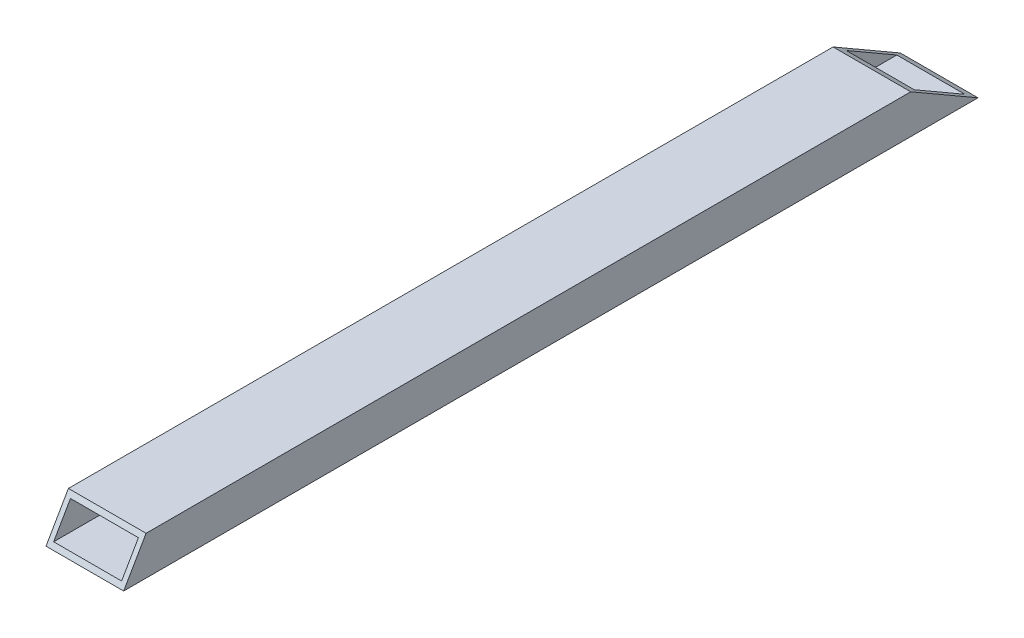
ISO-10303-21;
HEADER;
FILE_DESCRIPTION(('STEP AP214'),'2;1');
FILE_NAME('part.step','',(''),(''),'','','');
FILE_SCHEMA(('AUTOMOTIVE_DESIGN { 1 0 10303 214 1 1 1 1 }'));
ENDSEC;
DATA;
#1=APPLICATION_CONTEXT('core data for automotive mechanical design processes');
#2=APPLICATION_PROTOCOL_DEFINITION('international standard','automotive_design',2000,#1);
#3=PRODUCT_CONTEXT('',#1,'mechanical');
#4=PRODUCT('Part','Part','',(#3));
#5=PRODUCT_RELATED_PRODUCT_CATEGORY('part','',(#4));
#6=PRODUCT_DEFINITION_FORMATION('','',#4);
#7=PRODUCT_DEFINITION_CONTEXT('part definition',#1,'design');
#8=PRODUCT_DEFINITION('design','',#6,#7);
#9=PRODUCT_DEFINITION_SHAPE('','',#8);
#10=(LENGTH_UNIT() NAMED_UNIT(*) SI_UNIT(.MILLI.,.METRE.));
#11=(NAMED_UNIT(*) PLANE_ANGLE_UNIT() SI_UNIT($,.RADIAN.));
#12=(NAMED_UNIT(*) SI_UNIT($,.STERADIAN.) SOLID_ANGLE_UNIT());
#13=UNCERTAINTY_MEASURE_WITH_UNIT(LENGTH_MEASURE(1.E-05),#10,'distance_accuracy_value','');
#14=(GEOMETRIC_REPRESENTATION_CONTEXT(3) GLOBAL_UNCERTAINTY_ASSIGNED_CONTEXT((#13)) GLOBAL_UNIT_ASSIGNED_CONTEXT((#10,
#11,#12)) REPRESENTATION_CONTEXT('',''));
#15=CARTESIAN_POINT('',(0.,0.,0.));
#16=DIRECTION('',(0.,0.,1.));
#17=DIRECTION('',(1.,0.,0.));
#18=AXIS2_PLACEMENT_3D('',#15,#16,#17);
#19=CARTESIAN_POINT('',(25.4,12.7,-235.405909487751));
#20=DIRECTION('',(0.,-0.866025403784438,0.500000000000001));
#21=DIRECTION('',(0.,-0.500000000000001,-0.866025403784438));
#22=AXIS2_PLACEMENT_3D('',#19,#20,#21);
#23=PLANE('',#22);
#24=DIRECTION('',(0.,-0.500000000000001,-0.866025403784438));
#25=VECTOR('',#24,1.);
#26=CARTESIAN_POINT('',(-25.4,60.4918744543431,-152.627954743875));
#27=LINE('',#26,#25);
#28=CARTESIAN_POINT('',(-25.4,12.7,-235.405909487751));
#29=VERTEX_POINT('',#28);
#30=CARTESIAN_POINT('',(-25.4,-12.7,-279.4));
#31=VERTEX_POINT('',#30);
#32=EDGE_CURVE('E35',#29,#31,#27,.T.);
#33=ORIENTED_EDGE('',*,*,#32,.F.);
#34=DIRECTION('',(-1.,0.,0.));
#35=VECTOR('',#34,1.);
#36=CARTESIAN_POINT('',(0.,12.7,-235.405909487751));
#37=LINE('',#36,#35);
#38=CARTESIAN_POINT('',(25.4,12.7,-235.405909487751));
#39=VERTEX_POINT('',#38);
#40=EDGE_CURVE('E131',#39,#29,#37,.T.);
#41=ORIENTED_EDGE('',*,*,#40,.F.);
#42=DIRECTION('',(0.,0.500000000000001,0.866025403784438));
#43=VECTOR('',#42,1.);
#44=CARTESIAN_POINT('',(25.4,63.6668744543431,-147.128693429844));
#45=LINE('',#44,#43);
#46=CARTESIAN_POINT('',(25.4,-12.7,-279.4));
#47=VERTEX_POINT('',#46);
#48=EDGE_CURVE('E10',#47,#39,#45,.T.);
#49=ORIENTED_EDGE('',*,*,#48,.F.);
#50=DIRECTION('',(1.,0.,0.));
#51=VECTOR('',#50,1.);
#52=CARTESIAN_POINT('',(25.4,-12.7,-279.4));
#53=LINE('',#52,#51);
#54=EDGE_CURVE('E144',#31,#47,#53,.T.);
#55=ORIENTED_EDGE('',*,*,#54,.F.);
#56=EDGE_LOOP('',(#33,#41,#49,#55));
#57=FACE_BOUND('',#56,.T.);
#58=DIRECTION('',(0.,0.500000000000001,0.866025403784438));
#59=VECTOR('',#58,1.);
#60=CARTESIAN_POINT('',(-22.225,60.8887494543431,-151.940547079621));
#61=LINE('',#60,#59);
#62=CARTESIAN_POINT('',(-22.225,-9.525,-273.900738685969));
#63=VERTEX_POINT('',#62);
#64=CARTESIAN_POINT('',(-22.225,9.525,-240.905170801782));
#65=VERTEX_POINT('',#64);
#66=EDGE_CURVE('E106',#63,#65,#61,.T.);
#67=ORIENTED_EDGE('',*,*,#66,.F.);
#68=DIRECTION('',(-1.,0.,0.));
#69=VECTOR('',#68,1.);
#70=CARTESIAN_POINT('',(23.8125,-9.525,-273.900738685969));
#71=LINE('',#70,#69);
#72=CARTESIAN_POINT('',(22.225,-9.525,-273.900738685969));
#73=VERTEX_POINT('',#72);
#74=EDGE_CURVE('E116',#73,#63,#71,.T.);
#75=ORIENTED_EDGE('',*,*,#74,.F.);
#76=DIRECTION('',(0.,-0.500000000000001,-0.866025403784438));
#77=VECTOR('',#76,1.);
#78=CARTESIAN_POINT('',(22.225,63.2699994543431,-147.816101094098));
#79=LINE('',#78,#77);
#80=CARTESIAN_POINT('',(22.225,9.525,-240.905170801782));
#81=VERTEX_POINT('',#80);
#82=EDGE_CURVE('E123',#81,#73,#79,.T.);
#83=ORIENTED_EDGE('',*,*,#82,.F.);
#84=DIRECTION('',(1.,0.,0.));
#85=VECTOR('',#84,1.);
#86=CARTESIAN_POINT('',(1.5875,9.52499999999999,-240.905170801782));
#87=LINE('',#86,#85);
#88=EDGE_CURVE('E93',#65,#81,#87,.T.);
#89=ORIENTED_EDGE('',*,*,#88,.F.);
#90=EDGE_LOOP('',(#67,#75,#83,#89));
#91=FACE_BOUND('',#90,.T.);
#92=ADVANCED_FACE('F16',(#57,#91),#23,.F.);
#93=CARTESIAN_POINT('',(25.4,12.7,0.));
#94=DIRECTION('',(1.,0.,0.));
#95=DIRECTION('',(0.,0.,-1.));
#96=AXIS2_PLACEMENT_3D('',#93,#94,#95);
#97=PLANE('',#96);
#98=ORIENTED_EDGE('',*,*,#48,.T.);
#99=DIRECTION('',(0.,0.,-1.));
#100=VECTOR('',#99,1.);
#101=CARTESIAN_POINT('',(25.4,12.7,0.));
#102=LINE('',#101,#100);
#103=CARTESIAN_POINT('',(25.4,12.7,264.735303162584));
#104=VERTEX_POINT('',#103);
#105=EDGE_CURVE('E128',#104,#39,#102,.T.);
#106=ORIENTED_EDGE('',*,*,#105,.F.);
#107=DIRECTION('',(0.,-0.866025403784439,0.5));
#108=VECTOR('',#107,1.);
#109=CARTESIAN_POINT('',(25.4,57.316874454343,238.975738685969));
#110=LINE('',#109,#108);
#111=CARTESIAN_POINT('',(25.4,-12.7,279.4));
#112=VERTEX_POINT('',#111);
#113=EDGE_CURVE('E26',#104,#112,#110,.T.);
#114=ORIENTED_EDGE('',*,*,#113,.T.);
#115=DIRECTION('',(0.,0.,-1.));
#116=VECTOR('',#115,1.);
#117=CARTESIAN_POINT('',(25.4,-12.7,0.));
#118=LINE('',#117,#116);
#119=EDGE_CURVE('E132',#112,#47,#118,.T.);
#120=ORIENTED_EDGE('',*,*,#119,.T.);
#121=EDGE_LOOP('',(#98,#106,#114,#120));
#122=FACE_BOUND('',#121,.T.);
#123=ADVANCED_FACE('F154',(#122),#97,.T.);
#124=CARTESIAN_POINT('',(-25.4,12.7,0.));
#125=DIRECTION('',(0.,1.,0.));
#126=DIRECTION('',(0.,0.,1.));
#127=AXIS2_PLACEMENT_3D('',#124,#125,#126);
#128=PLANE('',#127);
#129=ORIENTED_EDGE('',*,*,#40,.T.);
#130=DIRECTION('',(0.,0.,1.));
#131=VECTOR('',#130,1.);
#132=CARTESIAN_POINT('',(-25.4,12.7,0.));
#133=LINE('',#132,#131);
#134=CARTESIAN_POINT('',(-25.4,12.7,264.735303162584));
#135=VERTEX_POINT('',#134);
#136=EDGE_CURVE('E127',#29,#135,#133,.T.);
#137=ORIENTED_EDGE('',*,*,#136,.T.);
#138=DIRECTION('',(1.,0.,0.));
#139=VECTOR('',#138,1.);
#140=CARTESIAN_POINT('',(0.,12.7,264.735303162584));
#141=LINE('',#140,#139);
#142=EDGE_CURVE('E124',#135,#104,#141,.T.);
#143=ORIENTED_EDGE('',*,*,#142,.T.);
#144=ORIENTED_EDGE('',*,*,#105,.T.);
#145=EDGE_LOOP('',(#129,#137,#143,#144));
#146=FACE_BOUND('',#145,.T.);
#147=ADVANCED_FACE('F158',(#146),#128,.T.);
#148=CARTESIAN_POINT('',(22.225,9.525,0.));
#149=DIRECTION('',(1.,0.,0.));
#150=DIRECTION('',(0.,0.,-1.));
#151=AXIS2_PLACEMENT_3D('',#148,#149,#150);
#152=PLANE('',#151);
#153=ORIENTED_EDGE('',*,*,#82,.T.);
#154=DIRECTION('',(0.,0.,1.));
#155=VECTOR('',#154,1.);
#156=CARTESIAN_POINT('',(22.225,-9.525,0.));
#157=LINE('',#156,#155);
#158=CARTESIAN_POINT('',(22.225,-9.525,277.566912895323));
#159=VERTEX_POINT('',#158);
#160=EDGE_CURVE('E120',#73,#159,#157,.T.);
#161=ORIENTED_EDGE('',*,*,#160,.T.);
#162=DIRECTION('',(0.,0.866025403784439,-0.5));
#163=VECTOR('',#162,1.);
#164=CARTESIAN_POINT('',(22.225,56.126249454343,239.663146350223));
#165=LINE('',#164,#163);
#166=CARTESIAN_POINT('',(22.225,9.525,266.568390267261));
#167=VERTEX_POINT('',#166);
#168=EDGE_CURVE('E118',#159,#167,#165,.T.);
#169=ORIENTED_EDGE('',*,*,#168,.T.);
#170=DIRECTION('',(0.,0.,-1.));
#171=VECTOR('',#170,1.);
#172=CARTESIAN_POINT('',(22.225,9.525,0.));
#173=LINE('',#172,#171);
#174=EDGE_CURVE('E90',#167,#81,#173,.T.);
#175=ORIENTED_EDGE('',*,*,#174,.T.);
#176=EDGE_LOOP('',(#153,#161,#169,#175));
#177=FACE_BOUND('',#176,.T.);
#178=ADVANCED_FACE('F160',(#177),#152,.F.);
#179=CARTESIAN_POINT('',(22.225,-9.525,0.));
#180=DIRECTION('',(0.,-1.,0.));
#181=DIRECTION('',(0.,0.,-1.));
#182=AXIS2_PLACEMENT_3D('',#179,#180,#181);
#183=PLANE('',#182);
#184=ORIENTED_EDGE('',*,*,#74,.T.);
#185=DIRECTION('',(0.,0.,1.));
#186=VECTOR('',#185,1.);
#187=CARTESIAN_POINT('',(-22.225,-9.525,0.));
#188=LINE('',#187,#186);
#189=CARTESIAN_POINT('',(-22.225,-9.525,277.566912895323));
#190=VERTEX_POINT('',#189);
#191=EDGE_CURVE('E114',#63,#190,#188,.T.);
#192=ORIENTED_EDGE('',*,*,#191,.T.);
#193=DIRECTION('',(1.,0.,0.));
#194=VECTOR('',#193,1.);
#195=CARTESIAN_POINT('',(23.8125,-9.525,277.566912895323));
#196=LINE('',#195,#194);
#197=EDGE_CURVE('E99',#190,#159,#196,.T.);
#198=ORIENTED_EDGE('',*,*,#197,.T.);
#199=ORIENTED_EDGE('',*,*,#160,.F.);
#200=EDGE_LOOP('',(#184,#192,#198,#199));
#201=FACE_BOUND('',#200,.T.);
#202=ADVANCED_FACE('F167',(#201),#183,.F.);
#203=CARTESIAN_POINT('',(25.4,-12.7,279.4));
#204=DIRECTION('',(0.,-0.5,-0.866025403784439));
#205=DIRECTION('',(0.,0.866025403784439,-0.5));
#206=AXIS2_PLACEMENT_3D('',#203,#204,#205);
#207=PLANE('',#206);
#208=DIRECTION('',(0.,0.866025403784439,-0.5));
#209=VECTOR('',#208,1.);
#210=CARTESIAN_POINT('',(-25.4,47.791874454343,244.475));
#211=LINE('',#210,#209);
#212=CARTESIAN_POINT('',(-25.4,-12.7,279.4));
#213=VERTEX_POINT('',#212);
#214=EDGE_CURVE('E110',#213,#135,#211,.T.);
#215=ORIENTED_EDGE('',*,*,#214,.F.);
#216=DIRECTION('',(-1.,0.,0.));
#217=VECTOR('',#216,1.);
#218=CARTESIAN_POINT('',(25.4,-12.7,279.4));
#219=LINE('',#218,#217);
#220=EDGE_CURVE('E78',#112,#213,#219,.T.);
#221=ORIENTED_EDGE('',*,*,#220,.F.);
#222=ORIENTED_EDGE('',*,*,#113,.F.);
#223=ORIENTED_EDGE('',*,*,#142,.F.);
#224=EDGE_LOOP('',(#215,#221,#222,#223));
#225=FACE_BOUND('',#224,.T.);
#226=ORIENTED_EDGE('',*,*,#168,.F.);
#227=ORIENTED_EDGE('',*,*,#197,.F.);
#228=DIRECTION('',(0.,-0.866025403784439,0.5));
#229=VECTOR('',#228,1.);
#230=CARTESIAN_POINT('',(-22.225,48.982499454343,243.787592335746));
#231=LINE('',#230,#229);
#232=CARTESIAN_POINT('',(-22.225,9.525,266.568390267261));
#233=VERTEX_POINT('',#232);
#234=EDGE_CURVE('E96',#233,#190,#231,.T.);
#235=ORIENTED_EDGE('',*,*,#234,.F.);
#236=DIRECTION('',(-1.,0.,0.));
#237=VECTOR('',#236,1.);
#238=CARTESIAN_POINT('',(1.5875,9.52500000000001,266.568390267261));
#239=LINE('',#238,#237);
#240=EDGE_CURVE('E84',#167,#233,#239,.T.);
#241=ORIENTED_EDGE('',*,*,#240,.F.);
#242=EDGE_LOOP('',(#226,#227,#235,#241));
#243=FACE_BOUND('',#242,.T.);
#244=ADVANCED_FACE('F97',(#225,#243),#207,.F.);
#245=CARTESIAN_POINT('',(-22.225,-9.525,0.));
#246=DIRECTION('',(-1.,0.,0.));
#247=DIRECTION('',(0.,0.,1.));
#248=AXIS2_PLACEMENT_3D('',#245,#246,#247);
#249=PLANE('',#248);
#250=ORIENTED_EDGE('',*,*,#66,.T.);
#251=DIRECTION('',(0.,0.,1.));
#252=VECTOR('',#251,1.);
#253=CARTESIAN_POINT('',(-22.225,9.525,0.));
#254=LINE('',#253,#252);
#255=EDGE_CURVE('E88',#65,#233,#254,.T.);
#256=ORIENTED_EDGE('',*,*,#255,.T.);
#257=ORIENTED_EDGE('',*,*,#234,.T.);
#258=ORIENTED_EDGE('',*,*,#191,.F.);
#259=EDGE_LOOP('',(#250,#256,#257,#258));
#260=FACE_BOUND('',#259,.T.);
#261=ADVANCED_FACE('F105',(#260),#249,.F.);
#262=CARTESIAN_POINT('',(-25.4,-12.7,0.));
#263=DIRECTION('',(-1.,0.,0.));
#264=DIRECTION('',(0.,0.,1.));
#265=AXIS2_PLACEMENT_3D('',#262,#263,#264);
#266=PLANE('',#265);
#267=ORIENTED_EDGE('',*,*,#32,.T.);
#268=DIRECTION('',(0.,0.,-1.));
#269=VECTOR('',#268,1.);
#270=CARTESIAN_POINT('',(-25.4,-12.7,0.));
#271=LINE('',#270,#269);
#272=EDGE_CURVE('E20',#213,#31,#271,.T.);
#273=ORIENTED_EDGE('',*,*,#272,.F.);
#274=ORIENTED_EDGE('',*,*,#214,.T.);
#275=ORIENTED_EDGE('',*,*,#136,.F.);
#276=EDGE_LOOP('',(#267,#273,#274,#275));
#277=FACE_BOUND('',#276,.T.);
#278=ADVANCED_FACE('F150',(#277),#266,.T.);
#279=CARTESIAN_POINT('',(-22.225,9.525,0.));
#280=DIRECTION('',(0.,1.,0.));
#281=DIRECTION('',(0.,0.,1.));
#282=AXIS2_PLACEMENT_3D('',#279,#280,#281);
#283=PLANE('',#282);
#284=ORIENTED_EDGE('',*,*,#88,.T.);
#285=ORIENTED_EDGE('',*,*,#174,.F.);
#286=ORIENTED_EDGE('',*,*,#240,.T.);
#287=ORIENTED_EDGE('',*,*,#255,.F.);
#288=EDGE_LOOP('',(#284,#285,#286,#287));
#289=FACE_BOUND('',#288,.T.);
#290=ADVANCED_FACE('F86',(#289),#283,.F.);
#291=CARTESIAN_POINT('',(25.4,-12.7,0.));
#292=DIRECTION('',(0.,-1.,0.));
#293=DIRECTION('',(0.,0.,-1.));
#294=AXIS2_PLACEMENT_3D('',#291,#292,#293);
#295=PLANE('',#294);
#296=ORIENTED_EDGE('',*,*,#220,.T.);
#297=ORIENTED_EDGE('',*,*,#272,.T.);
#298=ORIENTED_EDGE('',*,*,#54,.T.);
#299=ORIENTED_EDGE('',*,*,#119,.F.);
#300=EDGE_LOOP('',(#296,#297,#298,#299));
#301=FACE_BOUND('',#300,.T.);
#302=ADVANCED_FACE('F18',(#301),#295,.T.);
#303=CLOSED_SHELL('',(#92,#123,#147,#178,#202,#244,#261,#278,#290,#302));
#304=MANIFOLD_SOLID_BREP('B1',#303);
#305=ADVANCED_BREP_SHAPE_REPRESENTATION('',(#18,#304),#14);
#306=SHAPE_DEFINITION_REPRESENTATION(#9,#305);
ENDSEC;
END-ISO-10303-21;
